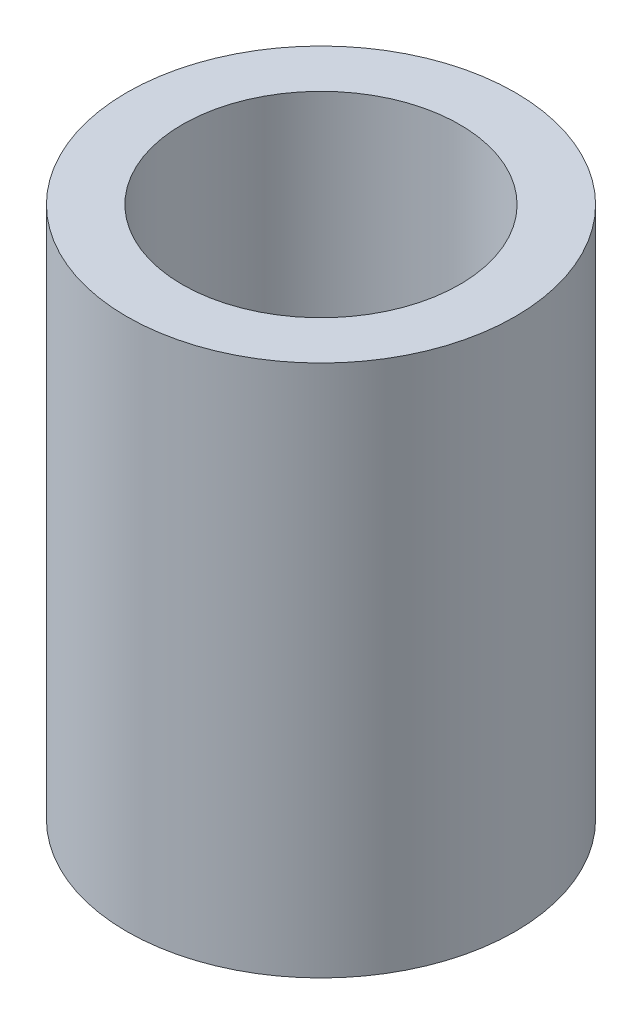
ISO-10303-21;
HEADER;
FILE_DESCRIPTION(('STEP AP214'),'2;1');
FILE_NAME('part.step','',(''),(''),'','','');
FILE_SCHEMA(('AUTOMOTIVE_DESIGN { 1 0 10303 214 1 1 1 1 }'));
ENDSEC;
DATA;
#1=APPLICATION_CONTEXT('core data for automotive mechanical design processes');
#2=APPLICATION_PROTOCOL_DEFINITION('international standard','automotive_design',2000,#1);
#3=PRODUCT_CONTEXT('',#1,'mechanical');
#4=PRODUCT('Part','Part','',(#3));
#5=PRODUCT_RELATED_PRODUCT_CATEGORY('part','',(#4));
#6=PRODUCT_DEFINITION_FORMATION('','',#4);
#7=PRODUCT_DEFINITION_CONTEXT('part definition',#1,'design');
#8=PRODUCT_DEFINITION('design','',#6,#7);
#9=PRODUCT_DEFINITION_SHAPE('','',#8);
#10=(LENGTH_UNIT() NAMED_UNIT(*) SI_UNIT(.MILLI.,.METRE.));
#11=(NAMED_UNIT(*) PLANE_ANGLE_UNIT() SI_UNIT($,.RADIAN.));
#12=(NAMED_UNIT(*) SI_UNIT($,.STERADIAN.) SOLID_ANGLE_UNIT());
#13=UNCERTAINTY_MEASURE_WITH_UNIT(LENGTH_MEASURE(1.E-05),#10,'distance_accuracy_value','');
#14=(GEOMETRIC_REPRESENTATION_CONTEXT(3) GLOBAL_UNCERTAINTY_ASSIGNED_CONTEXT((#13)) GLOBAL_UNIT_ASSIGNED_CONTEXT((#10,
#11,#12)) REPRESENTATION_CONTEXT('',''));
#15=CARTESIAN_POINT('',(0.,0.,0.));
#16=DIRECTION('',(0.,0.,1.));
#17=DIRECTION('',(1.,0.,0.));
#18=AXIS2_PLACEMENT_3D('',#15,#16,#17);
#19=CARTESIAN_POINT('',(0.,9.6,0.));
#20=DIRECTION('',(0.,1.,0.));
#21=DIRECTION('',(0.,0.,1.));
#22=AXIS2_PLACEMENT_3D('',#19,#20,#21);
#23=PLANE('',#22);
#24=CARTESIAN_POINT('',(0.,9.6,0.));
#25=DIRECTION('',(0.,1.,0.));
#26=DIRECTION('',(0.,0.,1.));
#27=AXIS2_PLACEMENT_3D('',#24,#25,#26);
#28=CIRCLE('',#27,3.5);
#29=CARTESIAN_POINT('',(0.,9.6,3.5));
#30=VERTEX_POINT('',#29);
#31=EDGE_CURVE('E10',#30,#30,#28,.T.);
#32=ORIENTED_EDGE('',*,*,#31,.T.);
#33=EDGE_LOOP('',(#32));
#34=FACE_BOUND('',#33,.T.);
#35=CARTESIAN_POINT('',(0.,9.6,0.));
#36=DIRECTION('',(0.,1.,0.));
#37=DIRECTION('',(0.,0.,1.));
#38=AXIS2_PLACEMENT_3D('',#35,#36,#37);
#39=CIRCLE('',#38,2.5);
#40=CARTESIAN_POINT('',(0.,9.6,2.5));
#41=VERTEX_POINT('',#40);
#42=EDGE_CURVE('E54',#41,#41,#39,.T.);
#43=ORIENTED_EDGE('',*,*,#42,.F.);
#44=EDGE_LOOP('',(#43));
#45=FACE_BOUND('',#44,.T.);
#46=ADVANCED_FACE('F41',(#34,#45),#23,.T.);
#47=CARTESIAN_POINT('',(0.,0.,0.));
#48=DIRECTION('',(0.,1.,0.));
#49=DIRECTION('',(0.,0.,1.));
#50=AXIS2_PLACEMENT_3D('',#47,#48,#49);
#51=PLANE('',#50);
#52=CARTESIAN_POINT('',(0.,0.,0.));
#53=DIRECTION('',(0.,1.,0.));
#54=DIRECTION('',(0.,0.,1.));
#55=AXIS2_PLACEMENT_3D('',#52,#53,#54);
#56=CIRCLE('',#55,3.5);
#57=CARTESIAN_POINT('',(0.,0.,3.5));
#58=VERTEX_POINT('',#57);
#59=EDGE_CURVE('E45',#58,#58,#56,.T.);
#60=ORIENTED_EDGE('',*,*,#59,.F.);
#61=EDGE_LOOP('',(#60));
#62=FACE_BOUND('',#61,.T.);
#63=CARTESIAN_POINT('',(0.,0.,0.));
#64=DIRECTION('',(0.,1.,0.));
#65=DIRECTION('',(0.,0.,1.));
#66=AXIS2_PLACEMENT_3D('',#63,#64,#65);
#67=CIRCLE('',#66,2.5);
#68=CARTESIAN_POINT('',(0.,0.,2.5));
#69=VERTEX_POINT('',#68);
#70=EDGE_CURVE('E56',#69,#69,#67,.T.);
#71=ORIENTED_EDGE('',*,*,#70,.T.);
#72=EDGE_LOOP('',(#71));
#73=FACE_BOUND('',#72,.T.);
#74=ADVANCED_FACE('F68',(#62,#73),#51,.F.);
#75=CARTESIAN_POINT('',(0.,9.6,0.));
#76=DIRECTION('',(0.,-1.,0.));
#77=DIRECTION('',(0.,0.,-1.));
#78=AXIS2_PLACEMENT_3D('',#75,#76,#77);
#79=CYLINDRICAL_SURFACE('',#78,3.5);
#80=ORIENTED_EDGE('',*,*,#31,.F.);
#81=EDGE_LOOP('',(#80));
#82=FACE_BOUND('',#81,.T.);
#83=ORIENTED_EDGE('',*,*,#59,.T.);
#84=EDGE_LOOP('',(#83));
#85=FACE_BOUND('',#84,.T.);
#86=ADVANCED_FACE('F43',(#82,#85),#79,.T.);
#87=CARTESIAN_POINT('',(0.,9.6,0.));
#88=DIRECTION('',(0.,-1.,0.));
#89=DIRECTION('',(0.,0.,-1.));
#90=AXIS2_PLACEMENT_3D('',#87,#88,#89);
#91=CYLINDRICAL_SURFACE('',#90,2.5);
#92=ORIENTED_EDGE('',*,*,#42,.T.);
#93=EDGE_LOOP('',(#92));
#94=FACE_BOUND('',#93,.T.);
#95=ORIENTED_EDGE('',*,*,#70,.F.);
#96=EDGE_LOOP('',(#95));
#97=FACE_BOUND('',#96,.T.);
#98=ADVANCED_FACE('F64',(#94,#97),#91,.F.);
#99=CLOSED_SHELL('',(#46,#74,#86,#98));
#100=MANIFOLD_SOLID_BREP('B2',#99);
#101=ADVANCED_BREP_SHAPE_REPRESENTATION('',(#18,#100),#14);
#102=SHAPE_DEFINITION_REPRESENTATION(#9,#101);
ENDSEC;
END-ISO-10303-21;
